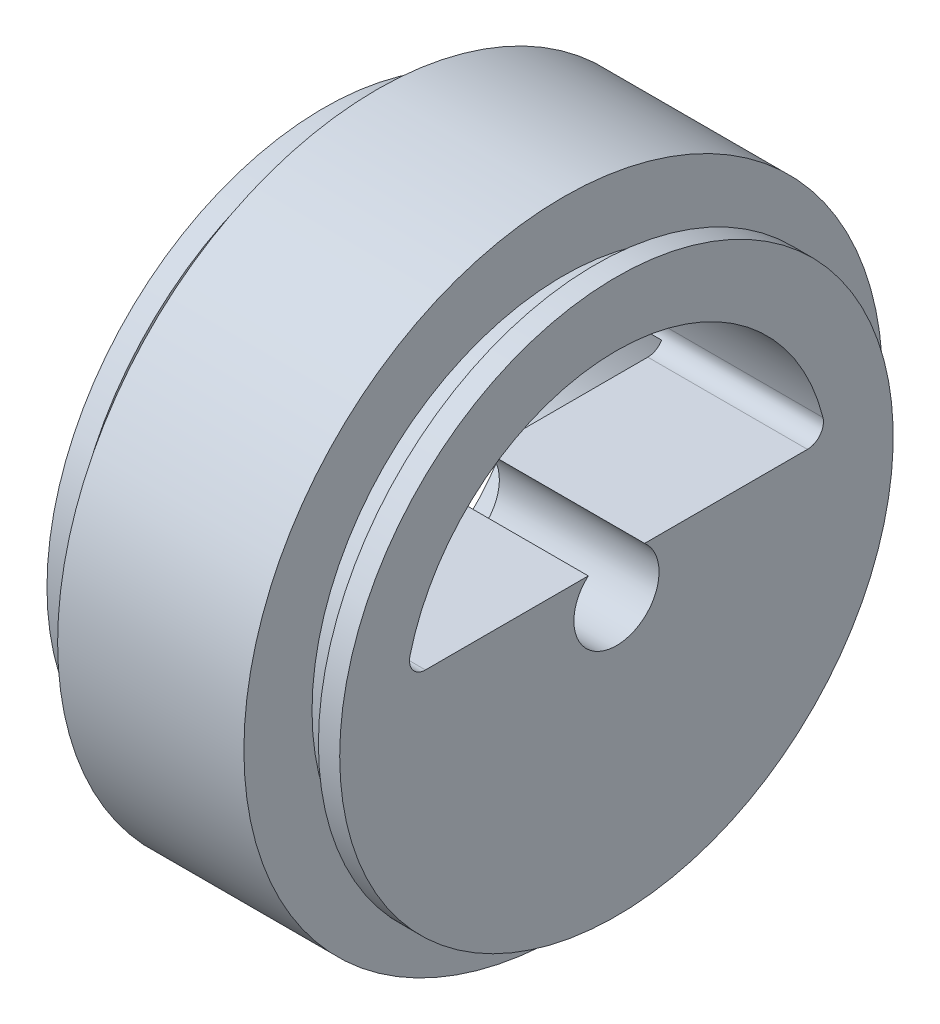
ISO-10303-21;
HEADER;
FILE_DESCRIPTION(('STEP AP214'),'2;1');
FILE_NAME('part.step','',(''),(''),'','','');
FILE_SCHEMA(('AUTOMOTIVE_DESIGN { 1 0 10303 214 1 1 1 1 }'));
ENDSEC;
DATA;
#1=APPLICATION_CONTEXT('core data for automotive mechanical design processes');
#2=APPLICATION_PROTOCOL_DEFINITION('international standard','automotive_design',2000,#1);
#3=PRODUCT_CONTEXT('',#1,'mechanical');
#4=PRODUCT('Part','Part','',(#3));
#5=PRODUCT_RELATED_PRODUCT_CATEGORY('part','',(#4));
#6=PRODUCT_DEFINITION_FORMATION('','',#4);
#7=PRODUCT_DEFINITION_CONTEXT('part definition',#1,'design');
#8=PRODUCT_DEFINITION('design','',#6,#7);
#9=PRODUCT_DEFINITION_SHAPE('','',#8);
#10=(LENGTH_UNIT() NAMED_UNIT(*) SI_UNIT(.MILLI.,.METRE.));
#11=(NAMED_UNIT(*) PLANE_ANGLE_UNIT() SI_UNIT($,.RADIAN.));
#12=(NAMED_UNIT(*) SI_UNIT($,.STERADIAN.) SOLID_ANGLE_UNIT());
#13=UNCERTAINTY_MEASURE_WITH_UNIT(LENGTH_MEASURE(1.E-05),#10,'distance_accuracy_value','');
#14=(GEOMETRIC_REPRESENTATION_CONTEXT(3) GLOBAL_UNCERTAINTY_ASSIGNED_CONTEXT((#13)) GLOBAL_UNIT_ASSIGNED_CONTEXT((#10,
#11,#12)) REPRESENTATION_CONTEXT('',''));
#15=CARTESIAN_POINT('',(0.,0.,0.));
#16=DIRECTION('',(0.,0.,1.));
#17=DIRECTION('',(1.,0.,0.));
#18=AXIS2_PLACEMENT_3D('',#15,#16,#17);
#19=CARTESIAN_POINT('',(20.,23.6,0.));
#20=DIRECTION('',(-1.,0.,0.));
#21=DIRECTION('',(0.,0.,1.));
#22=AXIS2_PLACEMENT_3D('',#19,#20,#21);
#23=PLANE('',#22);
#24=CARTESIAN_POINT('',(20.,0.,0.));
#25=DIRECTION('',(-1.,0.,0.));
#26=DIRECTION('',(0.,0.,1.));
#27=AXIS2_PLACEMENT_3D('',#24,#25,#26);
#28=CIRCLE('',#27,30.);
#29=CARTESIAN_POINT('',(20.,0.,30.));
#30=VERTEX_POINT('',#29);
#31=EDGE_CURVE('E146',#30,#30,#28,.T.);
#32=ORIENTED_EDGE('',*,*,#31,.F.);
#33=EDGE_LOOP('',(#32));
#34=FACE_BOUND('',#33,.T.);
#35=CARTESIAN_POINT('',(20.,0.,0.));
#36=DIRECTION('',(-1.,0.,0.));
#37=DIRECTION('',(0.,0.,1.));
#38=AXIS2_PLACEMENT_3D('',#35,#36,#37);
#39=CIRCLE('',#38,23.6);
#40=CARTESIAN_POINT('',(20.,0.,23.6));
#41=VERTEX_POINT('',#40);
#42=EDGE_CURVE('E184',#41,#41,#39,.T.);
#43=ORIENTED_EDGE('',*,*,#42,.T.);
#44=EDGE_LOOP('',(#43));
#45=FACE_BOUND('',#44,.T.);
#46=ADVANCED_FACE('F31',(#34,#45),#23,.F.);
#47=CARTESIAN_POINT('',(10.,0.,0.));
#48=DIRECTION('',(-1.,0.,0.));
#49=DIRECTION('',(0.,0.,1.));
#50=AXIS2_PLACEMENT_3D('',#47,#48,#49);
#51=CYLINDRICAL_SURFACE('',#50,23.6);
#52=ORIENTED_EDGE('',*,*,#42,.F.);
#53=EDGE_LOOP('',(#52));
#54=FACE_BOUND('',#53,.T.);
#55=CARTESIAN_POINT('',(23.,0.,0.));
#56=DIRECTION('',(-1.,0.,0.));
#57=DIRECTION('',(0.,0.,1.));
#58=AXIS2_PLACEMENT_3D('',#55,#56,#57);
#59=CIRCLE('',#58,23.6);
#60=CARTESIAN_POINT('',(23.,0.,23.6));
#61=VERTEX_POINT('',#60);
#62=EDGE_CURVE('E181',#61,#61,#59,.T.);
#63=ORIENTED_EDGE('',*,*,#62,.T.);
#64=EDGE_LOOP('',(#63));
#65=FACE_BOUND('',#64,.T.);
#66=ADVANCED_FACE('F221',(#54,#65),#51,.T.);
#67=CARTESIAN_POINT('',(23.,23.6,0.));
#68=DIRECTION('',(1.,0.,0.));
#69=DIRECTION('',(0.,0.,-1.));
#70=AXIS2_PLACEMENT_3D('',#67,#68,#69);
#71=PLANE('',#70);
#72=ORIENTED_EDGE('',*,*,#62,.F.);
#73=EDGE_LOOP('',(#72));
#74=FACE_BOUND('',#73,.T.);
#75=CARTESIAN_POINT('',(23.,0.,0.));
#76=DIRECTION('',(-1.,0.,0.));
#77=DIRECTION('',(0.,0.,1.));
#78=AXIS2_PLACEMENT_3D('',#75,#76,#77);
#79=CIRCLE('',#78,26.);
#80=CARTESIAN_POINT('',(23.,0.,26.));
#81=VERTEX_POINT('',#80);
#82=EDGE_CURVE('E178',#81,#81,#79,.T.);
#83=ORIENTED_EDGE('',*,*,#82,.T.);
#84=EDGE_LOOP('',(#83));
#85=FACE_BOUND('',#84,.T.);
#86=ADVANCED_FACE('F226',(#74,#85),#71,.F.);
#87=CARTESIAN_POINT('',(10.,0.,0.));
#88=DIRECTION('',(-1.,0.,0.));
#89=DIRECTION('',(0.,0.,1.));
#90=AXIS2_PLACEMENT_3D('',#87,#88,#89);
#91=CYLINDRICAL_SURFACE('',#90,26.);
#92=ORIENTED_EDGE('',*,*,#82,.F.);
#93=EDGE_LOOP('',(#92));
#94=FACE_BOUND('',#93,.T.);
#95=CARTESIAN_POINT('',(25.,0.,0.));
#96=DIRECTION('',(-1.,0.,0.));
#97=DIRECTION('',(0.,0.,1.));
#98=AXIS2_PLACEMENT_3D('',#95,#96,#97);
#99=CIRCLE('',#98,26.);
#100=CARTESIAN_POINT('',(25.,0.,26.));
#101=VERTEX_POINT('',#100);
#102=EDGE_CURVE('E175',#101,#101,#99,.T.);
#103=ORIENTED_EDGE('',*,*,#102,.T.);
#104=EDGE_LOOP('',(#103));
#105=FACE_BOUND('',#104,.T.);
#106=ADVANCED_FACE('F236',(#94,#105),#91,.T.);
#107=CARTESIAN_POINT('',(25.,4.,0.));
#108=DIRECTION('',(-1.,0.,0.));
#109=DIRECTION('',(0.,0.,1.));
#110=AXIS2_PLACEMENT_3D('',#107,#108,#109);
#111=PLANE('',#110);
#112=ORIENTED_EDGE('',*,*,#102,.F.);
#113=EDGE_LOOP('',(#112));
#114=FACE_BOUND('',#113,.T.);
#115=CARTESIAN_POINT('',(25.,4.5,-17.9443584449264));
#116=DIRECTION('',(1.,0.,0.));
#117=DIRECTION('',(0.,0.,-1.));
#118=AXIS2_PLACEMENT_3D('',#115,#116,#117);
#119=CIRCLE('',#118,1.5);
#120=CARTESIAN_POINT('',(25.,3.,-17.9443584449264));
#121=VERTEX_POINT('',#120);
#122=CARTESIAN_POINT('',(25.,4.86486486486487,-19.3993064269474));
#123=VERTEX_POINT('',#122);
#124=EDGE_CURVE('E126',#121,#123,#119,.T.);
#125=ORIENTED_EDGE('',*,*,#124,.F.);
#126=DIRECTION('',(0.,0.,-1.));
#127=VECTOR('',#126,1.);
#128=CARTESIAN_POINT('',(25.,3.,-17.9443584449264));
#129=LINE('',#128,#127);
#130=CARTESIAN_POINT('',(25.,3.,-2.64575131106459));
#131=VERTEX_POINT('',#130);
#132=EDGE_CURVE('E123',#131,#121,#129,.T.);
#133=ORIENTED_EDGE('',*,*,#132,.F.);
#134=CARTESIAN_POINT('',(25.,0.,0.));
#135=DIRECTION('',(-1.,0.,0.));
#136=DIRECTION('',(0.,0.,1.));
#137=AXIS2_PLACEMENT_3D('',#134,#135,#136);
#138=CIRCLE('',#137,4.);
#139=CARTESIAN_POINT('',(25.,3.,2.64575131106459));
#140=VERTEX_POINT('',#139);
#141=EDGE_CURVE('E172',#131,#140,#138,.T.);
#142=ORIENTED_EDGE('',*,*,#141,.T.);
#143=CARTESIAN_POINT('',(25.,3.,17.9443584449264));
#144=VERTEX_POINT('',#143);
#145=EDGE_CURVE('E124',#144,#140,#129,.T.);
#146=ORIENTED_EDGE('',*,*,#145,.F.);
#147=CARTESIAN_POINT('',(25.,4.5,17.9443584449264));
#148=DIRECTION('',(1.,0.,0.));
#149=DIRECTION('',(0.,0.,1.));
#150=AXIS2_PLACEMENT_3D('',#147,#148,#149);
#151=CIRCLE('',#150,1.5);
#152=CARTESIAN_POINT('',(25.,4.86486486486487,19.3993064269474));
#153=VERTEX_POINT('',#152);
#154=EDGE_CURVE('E121',#153,#144,#151,.T.);
#155=ORIENTED_EDGE('',*,*,#154,.F.);
#156=CARTESIAN_POINT('',(25.,0.,0.));
#157=DIRECTION('',(1.,0.,0.));
#158=DIRECTION('',(0.,0.,-1.));
#159=AXIS2_PLACEMENT_3D('',#156,#157,#158);
#160=CIRCLE('',#159,20.);
#161=EDGE_CURVE('E96',#123,#153,#160,.T.);
#162=ORIENTED_EDGE('',*,*,#161,.F.);
#163=EDGE_LOOP('',(#125,#133,#142,#146,#155,#162));
#164=FACE_BOUND('',#163,.T.);
#165=ADVANCED_FACE('F201',(#114,#164),#111,.F.);
#166=CARTESIAN_POINT('',(10.,0.,0.));
#167=DIRECTION('',(-1.,0.,0.));
#168=DIRECTION('',(0.,0.,1.));
#169=AXIS2_PLACEMENT_3D('',#166,#167,#168);
#170=CYLINDRICAL_SURFACE('',#169,4.);
#171=CARTESIAN_POINT('',(10.,0.,0.));
#172=DIRECTION('',(-1.,0.,0.));
#173=DIRECTION('',(0.,0.,1.));
#174=AXIS2_PLACEMENT_3D('',#171,#172,#173);
#175=CIRCLE('',#174,4.);
#176=CARTESIAN_POINT('',(10.,3.,-2.64575131106459));
#177=VERTEX_POINT('',#176);
#178=CARTESIAN_POINT('',(10.,3.,2.64575131106459));
#179=VERTEX_POINT('',#178);
#180=EDGE_CURVE('E169',#177,#179,#175,.T.);
#181=ORIENTED_EDGE('',*,*,#180,.T.);
#182=DIRECTION('',(-1.,0.,0.));
#183=VECTOR('',#182,1.);
#184=CARTESIAN_POINT('',(10.,3.,2.64575131106459));
#185=LINE('',#184,#183);
#186=EDGE_CURVE('E53',#179,#140,#185,.F.);
#187=ORIENTED_EDGE('',*,*,#186,.T.);
#188=ORIENTED_EDGE('',*,*,#141,.F.);
#189=DIRECTION('',(-1.,0.,0.));
#190=VECTOR('',#189,1.);
#191=CARTESIAN_POINT('',(10.,3.,-2.64575131106459));
#192=LINE('',#191,#190);
#193=EDGE_CURVE('E142',#131,#177,#192,.T.);
#194=ORIENTED_EDGE('',*,*,#193,.T.);
#195=EDGE_LOOP('',(#181,#187,#188,#194));
#196=FACE_BOUND('',#195,.T.);
#197=ADVANCED_FACE('F197',(#196),#170,.F.);
#198=CARTESIAN_POINT('',(10.,4.,0.));
#199=DIRECTION('',(1.,0.,0.));
#200=DIRECTION('',(0.,0.,-1.));
#201=AXIS2_PLACEMENT_3D('',#198,#199,#200);
#202=PLANE('',#201);
#203=CARTESIAN_POINT('',(10.,0.,0.));
#204=DIRECTION('',(-1.,0.,0.));
#205=DIRECTION('',(0.,0.,1.));
#206=AXIS2_PLACEMENT_3D('',#203,#204,#205);
#207=CIRCLE('',#206,19.6);
#208=CARTESIAN_POINT('',(10.,3.74293786080907,-19.2392935465448));
#209=VERTEX_POINT('',#208);
#210=CARTESIAN_POINT('',(10.,3.74293786080907,19.2392935465448));
#211=VERTEX_POINT('',#210);
#212=EDGE_CURVE('E166',#209,#211,#207,.T.);
#213=ORIENTED_EDGE('',*,*,#212,.T.);
#214=CARTESIAN_POINT('',(10.,4.5,17.9443584449264));
#215=DIRECTION('',(1.,0.,0.));
#216=DIRECTION('',(0.,0.,-1.));
#217=AXIS2_PLACEMENT_3D('',#214,#215,#216);
#218=CIRCLE('',#217,1.5);
#219=CARTESIAN_POINT('',(10.,3.,17.9443584449264));
#220=VERTEX_POINT('',#219);
#221=EDGE_CURVE('E139',#211,#220,#218,.T.);
#222=ORIENTED_EDGE('',*,*,#221,.T.);
#223=DIRECTION('',(0.,0.,-1.));
#224=VECTOR('',#223,1.);
#225=CARTESIAN_POINT('',(10.,3.,0.));
#226=LINE('',#225,#224);
#227=EDGE_CURVE('E11',#220,#179,#226,.T.);
#228=ORIENTED_EDGE('',*,*,#227,.T.);
#229=ORIENTED_EDGE('',*,*,#180,.F.);
#230=CARTESIAN_POINT('',(10.,3.,-17.9443584449264));
#231=VERTEX_POINT('',#230);
#232=EDGE_CURVE('E34',#177,#231,#226,.T.);
#233=ORIENTED_EDGE('',*,*,#232,.T.);
#234=CARTESIAN_POINT('',(10.,4.5,-17.9443584449264));
#235=DIRECTION('',(1.,0.,0.));
#236=DIRECTION('',(0.,0.,-1.));
#237=AXIS2_PLACEMENT_3D('',#234,#235,#236);
#238=CIRCLE('',#237,1.5);
#239=EDGE_CURVE('E135',#231,#209,#238,.T.);
#240=ORIENTED_EDGE('',*,*,#239,.T.);
#241=EDGE_LOOP('',(#213,#222,#228,#229,#233,#240));
#242=FACE_BOUND('',#241,.T.);
#243=ADVANCED_FACE('F189',(#242),#202,.F.);
#244=CARTESIAN_POINT('',(10.,0.,0.));
#245=DIRECTION('',(-1.,0.,0.));
#246=DIRECTION('',(0.,0.,1.));
#247=AXIS2_PLACEMENT_3D('',#244,#245,#246);
#248=CYLINDRICAL_SURFACE('',#247,19.6);
#249=CARTESIAN_POINT('',(-2.5,0.,0.));
#250=DIRECTION('',(-1.,0.,0.));
#251=DIRECTION('',(0.,0.,1.));
#252=AXIS2_PLACEMENT_3D('',#249,#250,#251);
#253=CIRCLE('',#252,19.6);
#254=CARTESIAN_POINT('',(-2.5,3.74293786080909,-19.2392935465449));
#255=VERTEX_POINT('',#254);
#256=CARTESIAN_POINT('',(-2.5,3.74293786080909,19.2392935465449));
#257=VERTEX_POINT('',#256);
#258=EDGE_CURVE('E164',#255,#257,#253,.T.);
#259=ORIENTED_EDGE('',*,*,#258,.T.);
#260=DIRECTION('',(1.,0.,0.));
#261=VECTOR('',#260,1.);
#262=CARTESIAN_POINT('',(11.25,3.74293786080907,19.2392935465448));
#263=LINE('',#262,#261);
#264=EDGE_CURVE('E107',#257,#211,#263,.T.);
#265=ORIENTED_EDGE('',*,*,#264,.T.);
#266=ORIENTED_EDGE('',*,*,#212,.F.);
#267=DIRECTION('',(1.,0.,0.));
#268=VECTOR('',#267,1.);
#269=CARTESIAN_POINT('',(11.25,3.74293786080907,-19.2392935465448));
#270=LINE('',#269,#268);
#271=EDGE_CURVE('E100',#209,#255,#270,.F.);
#272=ORIENTED_EDGE('',*,*,#271,.T.);
#273=EDGE_LOOP('',(#259,#265,#266,#272));
#274=FACE_BOUND('',#273,.T.);
#275=ADVANCED_FACE('F205',(#274),#248,.F.);
#276=CARTESIAN_POINT('',(-2.5,19.6,0.));
#277=DIRECTION('',(1.,0.,0.));
#278=DIRECTION('',(0.,0.,-1.));
#279=AXIS2_PLACEMENT_3D('',#276,#277,#278);
#280=PLANE('',#279);
#281=CARTESIAN_POINT('',(-2.5,0.,0.));
#282=DIRECTION('',(1.,0.,0.));
#283=DIRECTION('',(0.,0.,-1.));
#284=AXIS2_PLACEMENT_3D('',#281,#282,#283);
#285=CIRCLE('',#284,20.);
#286=CARTESIAN_POINT('',(-2.5,4.86486486486487,-19.3993064269474));
#287=VERTEX_POINT('',#286);
#288=CARTESIAN_POINT('',(-2.5,4.86486486486487,19.3993064269474));
#289=VERTEX_POINT('',#288);
#290=EDGE_CURVE('E45',#287,#289,#285,.T.);
#291=ORIENTED_EDGE('',*,*,#290,.T.);
#292=CARTESIAN_POINT('',(-2.5,4.5,17.9443584449264));
#293=DIRECTION('',(1.,0.,0.));
#294=DIRECTION('',(0.,0.,1.));
#295=AXIS2_PLACEMENT_3D('',#292,#293,#294);
#296=CIRCLE('',#295,1.5);
#297=EDGE_CURVE('E104',#289,#257,#296,.T.);
#298=ORIENTED_EDGE('',*,*,#297,.T.);
#299=ORIENTED_EDGE('',*,*,#258,.F.);
#300=CARTESIAN_POINT('',(-2.5,4.5,-17.9443584449264));
#301=DIRECTION('',(1.,0.,0.));
#302=DIRECTION('',(0.,0.,-1.));
#303=AXIS2_PLACEMENT_3D('',#300,#301,#302);
#304=CIRCLE('',#303,1.5);
#305=EDGE_CURVE('E115',#255,#287,#304,.T.);
#306=ORIENTED_EDGE('',*,*,#305,.T.);
#307=EDGE_LOOP('',(#291,#298,#299,#306));
#308=FACE_BOUND('',#307,.T.);
#309=CARTESIAN_POINT('',(-2.5,0.,0.));
#310=DIRECTION('',(-1.,0.,0.));
#311=DIRECTION('',(0.,0.,1.));
#312=AXIS2_PLACEMENT_3D('',#309,#310,#311);
#313=CIRCLE('',#312,26.);
#314=CARTESIAN_POINT('',(-2.5,0.,26.));
#315=VERTEX_POINT('',#314);
#316=EDGE_CURVE('E161',#315,#315,#313,.T.);
#317=ORIENTED_EDGE('',*,*,#316,.T.);
#318=EDGE_LOOP('',(#317));
#319=FACE_BOUND('',#318,.T.);
#320=ADVANCED_FACE('F113',(#308,#319),#280,.F.);
#321=CARTESIAN_POINT('',(10.,0.,0.));
#322=DIRECTION('',(-1.,0.,0.));
#323=DIRECTION('',(0.,0.,1.));
#324=AXIS2_PLACEMENT_3D('',#321,#322,#323);
#325=CYLINDRICAL_SURFACE('',#324,26.);
#326=ORIENTED_EDGE('',*,*,#316,.F.);
#327=EDGE_LOOP('',(#326));
#328=FACE_BOUND('',#327,.T.);
#329=CARTESIAN_POINT('',(-0.5,0.,0.));
#330=DIRECTION('',(-1.,0.,0.));
#331=DIRECTION('',(0.,0.,1.));
#332=AXIS2_PLACEMENT_3D('',#329,#330,#331);
#333=CIRCLE('',#332,26.);
#334=CARTESIAN_POINT('',(-0.5,0.,26.));
#335=VERTEX_POINT('',#334);
#336=EDGE_CURVE('E158',#335,#335,#333,.T.);
#337=ORIENTED_EDGE('',*,*,#336,.T.);
#338=EDGE_LOOP('',(#337));
#339=FACE_BOUND('',#338,.T.);
#340=ADVANCED_FACE('F258',(#328,#339),#325,.T.);
#341=CARTESIAN_POINT('',(-0.500000000000001,23.6,0.));
#342=DIRECTION('',(-1.,0.,0.));
#343=DIRECTION('',(0.,0.,1.));
#344=AXIS2_PLACEMENT_3D('',#341,#342,#343);
#345=PLANE('',#344);
#346=ORIENTED_EDGE('',*,*,#336,.F.);
#347=EDGE_LOOP('',(#346));
#348=FACE_BOUND('',#347,.T.);
#349=CARTESIAN_POINT('',(-0.5,0.,0.));
#350=DIRECTION('',(-1.,0.,0.));
#351=DIRECTION('',(0.,0.,1.));
#352=AXIS2_PLACEMENT_3D('',#349,#350,#351);
#353=CIRCLE('',#352,23.6);
#354=CARTESIAN_POINT('',(-0.5,0.,23.6));
#355=VERTEX_POINT('',#354);
#356=EDGE_CURVE('E155',#355,#355,#353,.T.);
#357=ORIENTED_EDGE('',*,*,#356,.T.);
#358=EDGE_LOOP('',(#357));
#359=FACE_BOUND('',#358,.T.);
#360=ADVANCED_FACE('F261',(#348,#359),#345,.F.);
#361=CARTESIAN_POINT('',(10.,0.,0.));
#362=DIRECTION('',(-1.,0.,0.));
#363=DIRECTION('',(0.,0.,1.));
#364=AXIS2_PLACEMENT_3D('',#361,#362,#363);
#365=CYLINDRICAL_SURFACE('',#364,23.6);
#366=ORIENTED_EDGE('',*,*,#356,.F.);
#367=EDGE_LOOP('',(#366));
#368=FACE_BOUND('',#367,.T.);
#369=CARTESIAN_POINT('',(2.5,0.,0.));
#370=DIRECTION('',(-1.,0.,0.));
#371=DIRECTION('',(0.,0.,1.));
#372=AXIS2_PLACEMENT_3D('',#369,#370,#371);
#373=CIRCLE('',#372,23.6);
#374=CARTESIAN_POINT('',(2.5,0.,23.6));
#375=VERTEX_POINT('',#374);
#376=EDGE_CURVE('E152',#375,#375,#373,.T.);
#377=ORIENTED_EDGE('',*,*,#376,.T.);
#378=EDGE_LOOP('',(#377));
#379=FACE_BOUND('',#378,.T.);
#380=ADVANCED_FACE('F265',(#368,#379),#365,.T.);
#381=CARTESIAN_POINT('',(2.5,23.6,0.));
#382=DIRECTION('',(1.,0.,0.));
#383=DIRECTION('',(0.,0.,-1.));
#384=AXIS2_PLACEMENT_3D('',#381,#382,#383);
#385=PLANE('',#384);
#386=ORIENTED_EDGE('',*,*,#376,.F.);
#387=EDGE_LOOP('',(#386));
#388=FACE_BOUND('',#387,.T.);
#389=CARTESIAN_POINT('',(2.5,0.,0.));
#390=DIRECTION('',(-1.,0.,0.));
#391=DIRECTION('',(0.,0.,1.));
#392=AXIS2_PLACEMENT_3D('',#389,#390,#391);
#393=CIRCLE('',#392,30.);
#394=CARTESIAN_POINT('',(2.5,0.,30.));
#395=VERTEX_POINT('',#394);
#396=EDGE_CURVE('E149',#395,#395,#393,.T.);
#397=ORIENTED_EDGE('',*,*,#396,.T.);
#398=EDGE_LOOP('',(#397));
#399=FACE_BOUND('',#398,.T.);
#400=ADVANCED_FACE('F215',(#388,#399),#385,.F.);
#401=CARTESIAN_POINT('',(10.,0.,0.));
#402=DIRECTION('',(-1.,0.,0.));
#403=DIRECTION('',(0.,0.,1.));
#404=AXIS2_PLACEMENT_3D('',#401,#402,#403);
#405=CYLINDRICAL_SURFACE('',#404,30.);
#406=ORIENTED_EDGE('',*,*,#396,.F.);
#407=EDGE_LOOP('',(#406));
#408=FACE_BOUND('',#407,.T.);
#409=ORIENTED_EDGE('',*,*,#31,.T.);
#410=EDGE_LOOP('',(#409));
#411=FACE_BOUND('',#410,.T.);
#412=ADVANCED_FACE('F209',(#408,#411),#405,.T.);
#413=CARTESIAN_POINT('',(-2.5,3.,-17.9443584449264));
#414=DIRECTION('',(0.,-1.,0.));
#415=DIRECTION('',(0.,0.,-1.));
#416=AXIS2_PLACEMENT_3D('',#413,#414,#415);
#417=PLANE('',#416);
#418=ORIENTED_EDGE('',*,*,#227,.F.);
#419=DIRECTION('',(1.,0.,0.));
#420=VECTOR('',#419,1.);
#421=CARTESIAN_POINT('',(-2.5,3.,17.9443584449264));
#422=LINE('',#421,#420);
#423=EDGE_CURVE('E116',#220,#144,#422,.T.);
#424=ORIENTED_EDGE('',*,*,#423,.T.);
#425=ORIENTED_EDGE('',*,*,#145,.T.);
#426=ORIENTED_EDGE('',*,*,#186,.F.);
#427=EDGE_LOOP('',(#418,#424,#425,#426));
#428=FACE_BOUND('',#427,.T.);
#429=ADVANCED_FACE('F207',(#428),#417,.F.);
#430=ORIENTED_EDGE('',*,*,#132,.T.);
#431=DIRECTION('',(1.,0.,0.));
#432=VECTOR('',#431,1.);
#433=CARTESIAN_POINT('',(-2.5,3.,-17.9443584449264));
#434=LINE('',#433,#432);
#435=EDGE_CURVE('E118',#231,#121,#434,.T.);
#436=ORIENTED_EDGE('',*,*,#435,.F.);
#437=ORIENTED_EDGE('',*,*,#232,.F.);
#438=ORIENTED_EDGE('',*,*,#193,.F.);
#439=EDGE_LOOP('',(#430,#436,#437,#438));
#440=FACE_BOUND('',#439,.T.);
#441=ADVANCED_FACE('F193',(#440),#417,.F.);
#442=CARTESIAN_POINT('',(-2.5,4.5,17.9443584449264));
#443=DIRECTION('',(1.,0.,0.));
#444=DIRECTION('',(0.,0.,-1.));
#445=AXIS2_PLACEMENT_3D('',#442,#443,#444);
#446=CYLINDRICAL_SURFACE('',#445,1.5);
#447=ORIENTED_EDGE('',*,*,#264,.F.);
#448=ORIENTED_EDGE('',*,*,#297,.F.);
#449=DIRECTION('',(1.,0.,0.));
#450=VECTOR('',#449,1.);
#451=CARTESIAN_POINT('',(-2.5,4.86486486486487,19.3993064269474));
#452=LINE('',#451,#450);
#453=EDGE_CURVE('E92',#289,#153,#452,.T.);
#454=ORIENTED_EDGE('',*,*,#453,.T.);
#455=ORIENTED_EDGE('',*,*,#154,.T.);
#456=ORIENTED_EDGE('',*,*,#423,.F.);
#457=ORIENTED_EDGE('',*,*,#221,.F.);
#458=EDGE_LOOP('',(#447,#448,#454,#455,#456,#457));
#459=FACE_BOUND('',#458,.T.);
#460=ADVANCED_FACE('F105',(#459),#446,.F.);
#461=CARTESIAN_POINT('',(-2.5,4.5,-17.9443584449264));
#462=DIRECTION('',(1.,0.,0.));
#463=DIRECTION('',(0.,0.,-1.));
#464=AXIS2_PLACEMENT_3D('',#461,#462,#463);
#465=CYLINDRICAL_SURFACE('',#464,1.5);
#466=ORIENTED_EDGE('',*,*,#435,.T.);
#467=ORIENTED_EDGE('',*,*,#124,.T.);
#468=DIRECTION('',(1.,0.,0.));
#469=VECTOR('',#468,1.);
#470=CARTESIAN_POINT('',(-2.5,4.86486486486487,-19.3993064269474));
#471=LINE('',#470,#469);
#472=EDGE_CURVE('E101',#287,#123,#471,.T.);
#473=ORIENTED_EDGE('',*,*,#472,.F.);
#474=ORIENTED_EDGE('',*,*,#305,.F.);
#475=ORIENTED_EDGE('',*,*,#271,.F.);
#476=ORIENTED_EDGE('',*,*,#239,.F.);
#477=EDGE_LOOP('',(#466,#467,#473,#474,#475,#476));
#478=FACE_BOUND('',#477,.T.);
#479=ADVANCED_FACE('F203',(#478),#465,.F.);
#480=CARTESIAN_POINT('',(-2.5,0.,0.));
#481=DIRECTION('',(1.,0.,0.));
#482=DIRECTION('',(0.,0.,-1.));
#483=AXIS2_PLACEMENT_3D('',#480,#481,#482);
#484=CYLINDRICAL_SURFACE('',#483,20.);
#485=ORIENTED_EDGE('',*,*,#161,.T.);
#486=ORIENTED_EDGE('',*,*,#453,.F.);
#487=ORIENTED_EDGE('',*,*,#290,.F.);
#488=ORIENTED_EDGE('',*,*,#472,.T.);
#489=EDGE_LOOP('',(#485,#486,#487,#488));
#490=FACE_BOUND('',#489,.T.);
#491=ADVANCED_FACE('F94',(#490),#484,.F.);
#492=CLOSED_SHELL('',(#46,#66,#86,#106,#165,#197,#243,#275,#320,#340,#360,#380,#400,#412,#429,
#441,#460,#479,#491));
#493=MANIFOLD_SOLID_BREP('B2',#492);
#494=ADVANCED_BREP_SHAPE_REPRESENTATION('',(#18,#493),#14);
#495=SHAPE_DEFINITION_REPRESENTATION(#9,#494);
ENDSEC;
END-ISO-10303-21;
